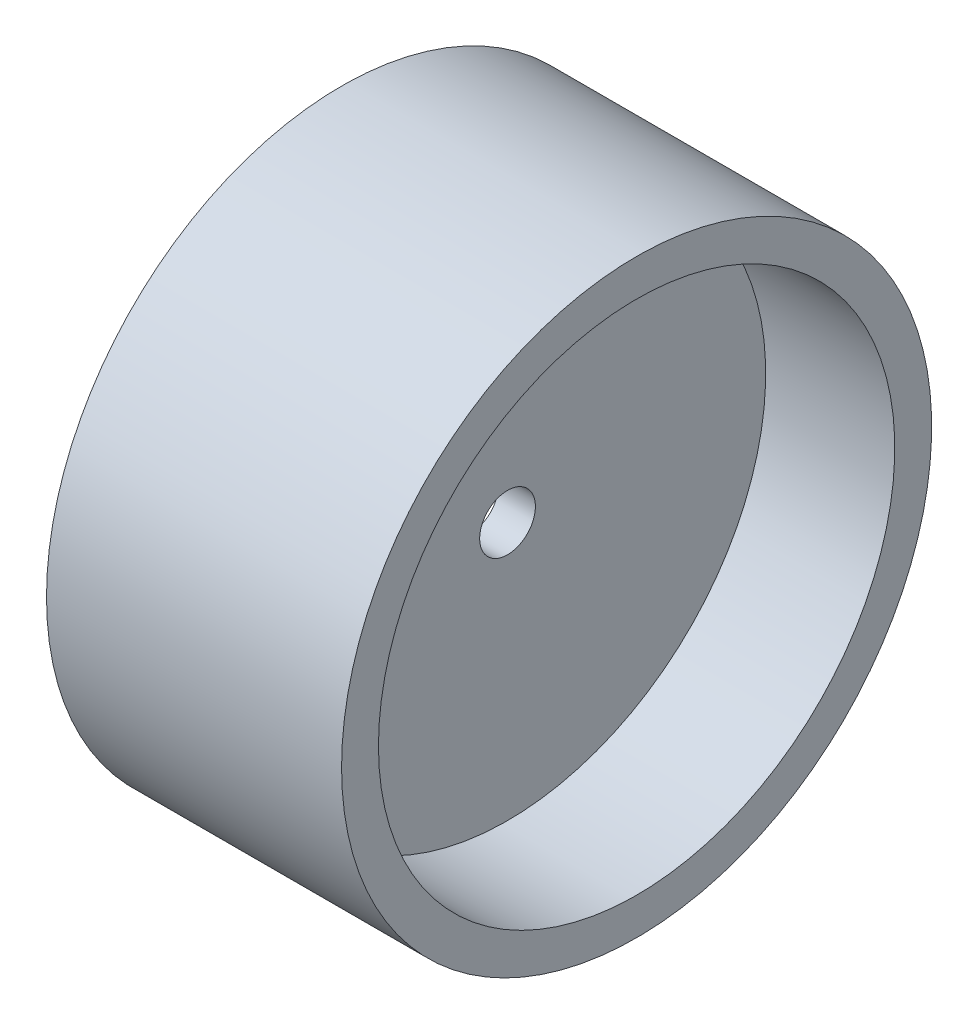
ISO-10303-21;
HEADER;
FILE_DESCRIPTION(('STEP AP214'),'2;1');
FILE_NAME('part.step','',(''),(''),'','','');
FILE_SCHEMA(('AUTOMOTIVE_DESIGN { 1 0 10303 214 1 1 1 1 }'));
ENDSEC;
DATA;
#1=APPLICATION_CONTEXT('core data for automotive mechanical design processes');
#2=APPLICATION_PROTOCOL_DEFINITION('international standard','automotive_design',2000,#1);
#3=PRODUCT_CONTEXT('',#1,'mechanical');
#4=PRODUCT('Part','Part','',(#3));
#5=PRODUCT_RELATED_PRODUCT_CATEGORY('part','',(#4));
#6=PRODUCT_DEFINITION_FORMATION('','',#4);
#7=PRODUCT_DEFINITION_CONTEXT('part definition',#1,'design');
#8=PRODUCT_DEFINITION('design','',#6,#7);
#9=PRODUCT_DEFINITION_SHAPE('','',#8);
#10=(LENGTH_UNIT() NAMED_UNIT(*) SI_UNIT(.MILLI.,.METRE.));
#11=(NAMED_UNIT(*) PLANE_ANGLE_UNIT() SI_UNIT($,.RADIAN.));
#12=(NAMED_UNIT(*) SI_UNIT($,.STERADIAN.) SOLID_ANGLE_UNIT());
#13=UNCERTAINTY_MEASURE_WITH_UNIT(LENGTH_MEASURE(1.E-05),#10,'distance_accuracy_value','');
#14=(GEOMETRIC_REPRESENTATION_CONTEXT(3) GLOBAL_UNCERTAINTY_ASSIGNED_CONTEXT((#13)) GLOBAL_UNIT_ASSIGNED_CONTEXT((#10,
#11,#12)) REPRESENTATION_CONTEXT('',''));
#15=CARTESIAN_POINT('',(0.,0.,0.));
#16=DIRECTION('',(0.,0.,1.));
#17=DIRECTION('',(1.,0.,0.));
#18=AXIS2_PLACEMENT_3D('',#15,#16,#17);
#19=CARTESIAN_POINT('',(0.,0.,0.));
#20=DIRECTION('',(-1.,0.,0.));
#21=DIRECTION('',(0.,0.,1.));
#22=AXIS2_PLACEMENT_3D('',#19,#20,#21);
#23=CYLINDRICAL_SURFACE('',#22,22.225);
#24=CARTESIAN_POINT('',(12.7,0.,0.));
#25=DIRECTION('',(-1.,0.,0.));
#26=DIRECTION('',(0.,0.,1.));
#27=AXIS2_PLACEMENT_3D('',#24,#25,#26);
#28=CIRCLE('',#27,22.225);
#29=CARTESIAN_POINT('',(12.7,0.,22.225));
#30=VERTEX_POINT('',#29);
#31=EDGE_CURVE('E10',#30,#30,#28,.T.);
#32=ORIENTED_EDGE('',*,*,#31,.F.);
#33=EDGE_LOOP('',(#32));
#34=FACE_BOUND('',#33,.T.);
#35=CARTESIAN_POINT('',(1.5875,0.,0.));
#36=DIRECTION('',(-1.,0.,0.));
#37=DIRECTION('',(0.,0.,1.));
#38=AXIS2_PLACEMENT_3D('',#35,#36,#37);
#39=CIRCLE('',#38,22.225);
#40=CARTESIAN_POINT('',(1.5875,0.,22.225));
#41=VERTEX_POINT('',#40);
#42=EDGE_CURVE('E63',#41,#41,#39,.T.);
#43=ORIENTED_EDGE('',*,*,#42,.T.);
#44=EDGE_LOOP('',(#43));
#45=FACE_BOUND('',#44,.T.);
#46=ADVANCED_FACE('F36',(#34,#45),#23,.F.);
#47=CARTESIAN_POINT('',(12.7,0.,0.));
#48=DIRECTION('',(-1.,0.,0.));
#49=DIRECTION('',(0.,0.,1.));
#50=AXIS2_PLACEMENT_3D('',#47,#48,#49);
#51=PLANE('',#50);
#52=CARTESIAN_POINT('',(12.7,0.,0.));
#53=DIRECTION('',(-1.,0.,0.));
#54=DIRECTION('',(0.,0.,1.));
#55=AXIS2_PLACEMENT_3D('',#52,#53,#54);
#56=CIRCLE('',#55,25.4);
#57=CARTESIAN_POINT('',(12.7,0.,25.4));
#58=VERTEX_POINT('',#57);
#59=EDGE_CURVE('E43',#58,#58,#56,.T.);
#60=ORIENTED_EDGE('',*,*,#59,.F.);
#61=EDGE_LOOP('',(#60));
#62=FACE_BOUND('',#61,.T.);
#63=ORIENTED_EDGE('',*,*,#31,.T.);
#64=EDGE_LOOP('',(#63));
#65=FACE_BOUND('',#64,.T.);
#66=ADVANCED_FACE('F100',(#62,#65),#51,.F.);
#67=CARTESIAN_POINT('',(0.,0.,0.));
#68=DIRECTION('',(-1.,0.,0.));
#69=DIRECTION('',(0.,0.,1.));
#70=AXIS2_PLACEMENT_3D('',#67,#68,#69);
#71=CYLINDRICAL_SURFACE('',#70,25.4);
#72=ORIENTED_EDGE('',*,*,#59,.T.);
#73=EDGE_LOOP('',(#72));
#74=FACE_BOUND('',#73,.T.);
#75=CARTESIAN_POINT('',(-12.7,0.,0.));
#76=DIRECTION('',(-1.,0.,0.));
#77=DIRECTION('',(0.,0.,1.));
#78=AXIS2_PLACEMENT_3D('',#75,#76,#77);
#79=CIRCLE('',#78,25.4);
#80=CARTESIAN_POINT('',(-12.7,0.,25.4));
#81=VERTEX_POINT('',#80);
#82=EDGE_CURVE('E48',#81,#81,#79,.T.);
#83=ORIENTED_EDGE('',*,*,#82,.F.);
#84=EDGE_LOOP('',(#83));
#85=FACE_BOUND('',#84,.T.);
#86=ADVANCED_FACE('F94',(#74,#85),#71,.T.);
#87=CARTESIAN_POINT('',(-12.7,0.,0.));
#88=DIRECTION('',(-1.,0.,0.));
#89=DIRECTION('',(0.,0.,1.));
#90=AXIS2_PLACEMENT_3D('',#87,#88,#89);
#91=PLANE('',#90);
#92=ORIENTED_EDGE('',*,*,#82,.T.);
#93=EDGE_LOOP('',(#92));
#94=FACE_BOUND('',#93,.T.);
#95=CARTESIAN_POINT('',(-12.7,0.,0.));
#96=DIRECTION('',(-1.,0.,0.));
#97=DIRECTION('',(0.,0.,1.));
#98=AXIS2_PLACEMENT_3D('',#95,#96,#97);
#99=CIRCLE('',#98,22.225);
#100=CARTESIAN_POINT('',(-12.7,0.,22.225));
#101=VERTEX_POINT('',#100);
#102=EDGE_CURVE('E53',#101,#101,#99,.T.);
#103=ORIENTED_EDGE('',*,*,#102,.F.);
#104=EDGE_LOOP('',(#103));
#105=FACE_BOUND('',#104,.T.);
#106=ADVANCED_FACE('F89',(#94,#105),#91,.T.);
#107=CARTESIAN_POINT('',(0.,0.,0.));
#108=DIRECTION('',(-1.,0.,0.));
#109=DIRECTION('',(0.,0.,1.));
#110=AXIS2_PLACEMENT_3D('',#107,#108,#109);
#111=CYLINDRICAL_SURFACE('',#110,22.225);
#112=CARTESIAN_POINT('',(-1.5875,0.,0.));
#113=DIRECTION('',(-1.,0.,0.));
#114=DIRECTION('',(0.,0.,1.));
#115=AXIS2_PLACEMENT_3D('',#112,#113,#114);
#116=CIRCLE('',#115,22.225);
#117=CARTESIAN_POINT('',(-1.5875,0.,22.225));
#118=VERTEX_POINT('',#117);
#119=EDGE_CURVE('E59',#118,#118,#116,.T.);
#120=ORIENTED_EDGE('',*,*,#119,.F.);
#121=EDGE_LOOP('',(#120));
#122=FACE_BOUND('',#121,.T.);
#123=ORIENTED_EDGE('',*,*,#102,.T.);
#124=EDGE_LOOP('',(#123));
#125=FACE_BOUND('',#124,.T.);
#126=ADVANCED_FACE('F83',(#122,#125),#111,.F.);
#127=CARTESIAN_POINT('',(-1.5875,0.,0.));
#128=DIRECTION('',(-1.,0.,0.));
#129=DIRECTION('',(0.,0.,1.));
#130=AXIS2_PLACEMENT_3D('',#127,#128,#129);
#131=PLANE('',#130);
#132=CARTESIAN_POINT('',(-1.5875,0.,0.));
#133=DIRECTION('',(-1.,0.,0.));
#134=DIRECTION('',(0.,0.,1.));
#135=AXIS2_PLACEMENT_3D('',#132,#133,#134);
#136=CIRCLE('',#135,2.4);
#137=CARTESIAN_POINT('',(-1.5875,0.,2.4));
#138=VERTEX_POINT('',#137);
#139=EDGE_CURVE('E71',#138,#138,#136,.T.);
#140=ORIENTED_EDGE('',*,*,#139,.F.);
#141=EDGE_LOOP('',(#140));
#142=FACE_BOUND('',#141,.T.);
#143=ORIENTED_EDGE('',*,*,#119,.T.);
#144=EDGE_LOOP('',(#143));
#145=FACE_BOUND('',#144,.T.);
#146=ADVANCED_FACE('F79',(#142,#145),#131,.T.);
#147=CARTESIAN_POINT('',(1.5875,0.,0.));
#148=DIRECTION('',(-1.,0.,0.));
#149=DIRECTION('',(0.,0.,1.));
#150=AXIS2_PLACEMENT_3D('',#147,#148,#149);
#151=PLANE('',#150);
#152=CARTESIAN_POINT('',(1.5875,0.,0.));
#153=DIRECTION('',(-1.,0.,0.));
#154=DIRECTION('',(0.,0.,1.));
#155=AXIS2_PLACEMENT_3D('',#152,#153,#154);
#156=CIRCLE('',#155,2.4);
#157=CARTESIAN_POINT('',(1.5875,0.,2.4));
#158=VERTEX_POINT('',#157);
#159=EDGE_CURVE('E67',#158,#158,#156,.T.);
#160=ORIENTED_EDGE('',*,*,#159,.T.);
#161=EDGE_LOOP('',(#160));
#162=FACE_BOUND('',#161,.T.);
#163=ORIENTED_EDGE('',*,*,#42,.F.);
#164=EDGE_LOOP('',(#163));
#165=FACE_BOUND('',#164,.T.);
#166=ADVANCED_FACE('F82',(#162,#165),#151,.F.);
#167=CARTESIAN_POINT('',(-1.5875,0.,0.));
#168=DIRECTION('',(-1.,0.,0.));
#169=DIRECTION('',(0.,0.,1.));
#170=AXIS2_PLACEMENT_3D('',#167,#168,#169);
#171=CYLINDRICAL_SURFACE('',#170,2.4);
#172=ORIENTED_EDGE('',*,*,#139,.T.);
#173=EDGE_LOOP('',(#172));
#174=FACE_BOUND('',#173,.T.);
#175=ORIENTED_EDGE('',*,*,#159,.F.);
#176=EDGE_LOOP('',(#175));
#177=FACE_BOUND('',#176,.T.);
#178=ADVANCED_FACE('F76',(#174,#177),#171,.F.);
#179=CLOSED_SHELL('',(#46,#66,#86,#106,#126,#146,#166,#178));
#180=MANIFOLD_SOLID_BREP('B2',#179);
#181=ADVANCED_BREP_SHAPE_REPRESENTATION('',(#18,#180),#14);
#182=SHAPE_DEFINITION_REPRESENTATION(#9,#181);
ENDSEC;
END-ISO-10303-21;
